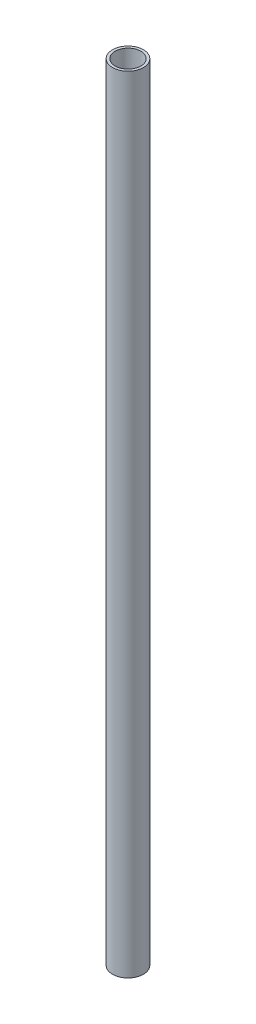
ISO-10303-21;
HEADER;
FILE_DESCRIPTION(('STEP AP214'),'2;1');
FILE_NAME('part.step','',(''),(''),'','','');
FILE_SCHEMA(('AUTOMOTIVE_DESIGN { 1 0 10303 214 1 1 1 1 }'));
ENDSEC;
DATA;
#1=APPLICATION_CONTEXT('core data for automotive mechanical design processes');
#2=APPLICATION_PROTOCOL_DEFINITION('international standard','automotive_design',2000,#1);
#3=PRODUCT_CONTEXT('',#1,'mechanical');
#4=PRODUCT('Part','Part','',(#3));
#5=PRODUCT_RELATED_PRODUCT_CATEGORY('part','',(#4));
#6=PRODUCT_DEFINITION_FORMATION('','',#4);
#7=PRODUCT_DEFINITION_CONTEXT('part definition',#1,'design');
#8=PRODUCT_DEFINITION('design','',#6,#7);
#9=PRODUCT_DEFINITION_SHAPE('','',#8);
#10=(LENGTH_UNIT() NAMED_UNIT(*) SI_UNIT(.MILLI.,.METRE.));
#11=(NAMED_UNIT(*) PLANE_ANGLE_UNIT() SI_UNIT($,.RADIAN.));
#12=(NAMED_UNIT(*) SI_UNIT($,.STERADIAN.) SOLID_ANGLE_UNIT());
#13=UNCERTAINTY_MEASURE_WITH_UNIT(LENGTH_MEASURE(1.E-05),#10,'distance_accuracy_value','');
#14=(GEOMETRIC_REPRESENTATION_CONTEXT(3) GLOBAL_UNCERTAINTY_ASSIGNED_CONTEXT((#13)) GLOBAL_UNIT_ASSIGNED_CONTEXT((#10,
#11,#12)) REPRESENTATION_CONTEXT('',''));
#15=CARTESIAN_POINT('',(0.,0.,0.));
#16=DIRECTION('',(0.,0.,1.));
#17=DIRECTION('',(1.,0.,0.));
#18=AXIS2_PLACEMENT_3D('',#15,#16,#17);
#19=CARTESIAN_POINT('',(0.,305.,0.));
#20=DIRECTION('',(0.,1.,0.));
#21=DIRECTION('',(0.,0.,1.));
#22=AXIS2_PLACEMENT_3D('',#19,#20,#21);
#23=PLANE('',#22);
#24=CARTESIAN_POINT('',(0.,305.,0.));
#25=DIRECTION('',(0.,1.,0.));
#26=DIRECTION('',(0.,0.,1.));
#27=AXIS2_PLACEMENT_3D('',#24,#25,#26);
#28=CIRCLE('',#27,6.);
#29=CARTESIAN_POINT('',(0.,305.,6.));
#30=VERTEX_POINT('',#29);
#31=EDGE_CURVE('E10',#30,#30,#28,.T.);
#32=ORIENTED_EDGE('',*,*,#31,.T.);
#33=EDGE_LOOP('',(#32));
#34=FACE_BOUND('',#33,.T.);
#35=CARTESIAN_POINT('',(0.,305.,0.));
#36=DIRECTION('',(0.,1.,0.));
#37=DIRECTION('',(0.,0.,1.));
#38=AXIS2_PLACEMENT_3D('',#35,#36,#37);
#39=CIRCLE('',#38,5.);
#40=CARTESIAN_POINT('',(0.,305.,5.));
#41=VERTEX_POINT('',#40);
#42=EDGE_CURVE('E50',#41,#41,#39,.T.);
#43=ORIENTED_EDGE('',*,*,#42,.F.);
#44=EDGE_LOOP('',(#43));
#45=FACE_BOUND('',#44,.T.);
#46=ADVANCED_FACE('F39',(#34,#45),#23,.T.);
#47=CARTESIAN_POINT('',(0.,0.,0.));
#48=DIRECTION('',(0.,1.,0.));
#49=DIRECTION('',(0.,0.,1.));
#50=AXIS2_PLACEMENT_3D('',#47,#48,#49);
#51=PLANE('',#50);
#52=CARTESIAN_POINT('',(0.,0.,0.));
#53=DIRECTION('',(0.,1.,0.));
#54=DIRECTION('',(0.,0.,1.));
#55=AXIS2_PLACEMENT_3D('',#52,#53,#54);
#56=CIRCLE('',#55,6.);
#57=CARTESIAN_POINT('',(0.,0.,6.));
#58=VERTEX_POINT('',#57);
#59=EDGE_CURVE('E43',#58,#58,#56,.T.);
#60=ORIENTED_EDGE('',*,*,#59,.F.);
#61=EDGE_LOOP('',(#60));
#62=FACE_BOUND('',#61,.T.);
#63=CARTESIAN_POINT('',(0.,0.,0.));
#64=DIRECTION('',(0.,1.,0.));
#65=DIRECTION('',(0.,0.,1.));
#66=AXIS2_PLACEMENT_3D('',#63,#64,#65);
#67=CIRCLE('',#66,5.);
#68=CARTESIAN_POINT('',(0.,0.,5.));
#69=VERTEX_POINT('',#68);
#70=EDGE_CURVE('E52',#69,#69,#67,.T.);
#71=ORIENTED_EDGE('',*,*,#70,.T.);
#72=EDGE_LOOP('',(#71));
#73=FACE_BOUND('',#72,.T.);
#74=ADVANCED_FACE('F62',(#62,#73),#51,.F.);
#75=CARTESIAN_POINT('',(0.,305.,0.));
#76=DIRECTION('',(0.,-1.,0.));
#77=DIRECTION('',(0.,0.,-1.));
#78=AXIS2_PLACEMENT_3D('',#75,#76,#77);
#79=CYLINDRICAL_SURFACE('',#78,6.);
#80=ORIENTED_EDGE('',*,*,#31,.F.);
#81=EDGE_LOOP('',(#80));
#82=FACE_BOUND('',#81,.T.);
#83=ORIENTED_EDGE('',*,*,#59,.T.);
#84=EDGE_LOOP('',(#83));
#85=FACE_BOUND('',#84,.T.);
#86=ADVANCED_FACE('F41',(#82,#85),#79,.T.);
#87=CARTESIAN_POINT('',(0.,305.,0.));
#88=DIRECTION('',(0.,-1.,0.));
#89=DIRECTION('',(0.,0.,-1.));
#90=AXIS2_PLACEMENT_3D('',#87,#88,#89);
#91=CYLINDRICAL_SURFACE('',#90,5.);
#92=ORIENTED_EDGE('',*,*,#42,.T.);
#93=EDGE_LOOP('',(#92));
#94=FACE_BOUND('',#93,.T.);
#95=ORIENTED_EDGE('',*,*,#70,.F.);
#96=EDGE_LOOP('',(#95));
#97=FACE_BOUND('',#96,.T.);
#98=ADVANCED_FACE('F58',(#94,#97),#91,.F.);
#99=CLOSED_SHELL('',(#46,#74,#86,#98));
#100=MANIFOLD_SOLID_BREP('B2',#99);
#101=ADVANCED_BREP_SHAPE_REPRESENTATION('',(#18,#100),#14);
#102=SHAPE_DEFINITION_REPRESENTATION(#9,#101);
ENDSEC;
END-ISO-10303-21;
